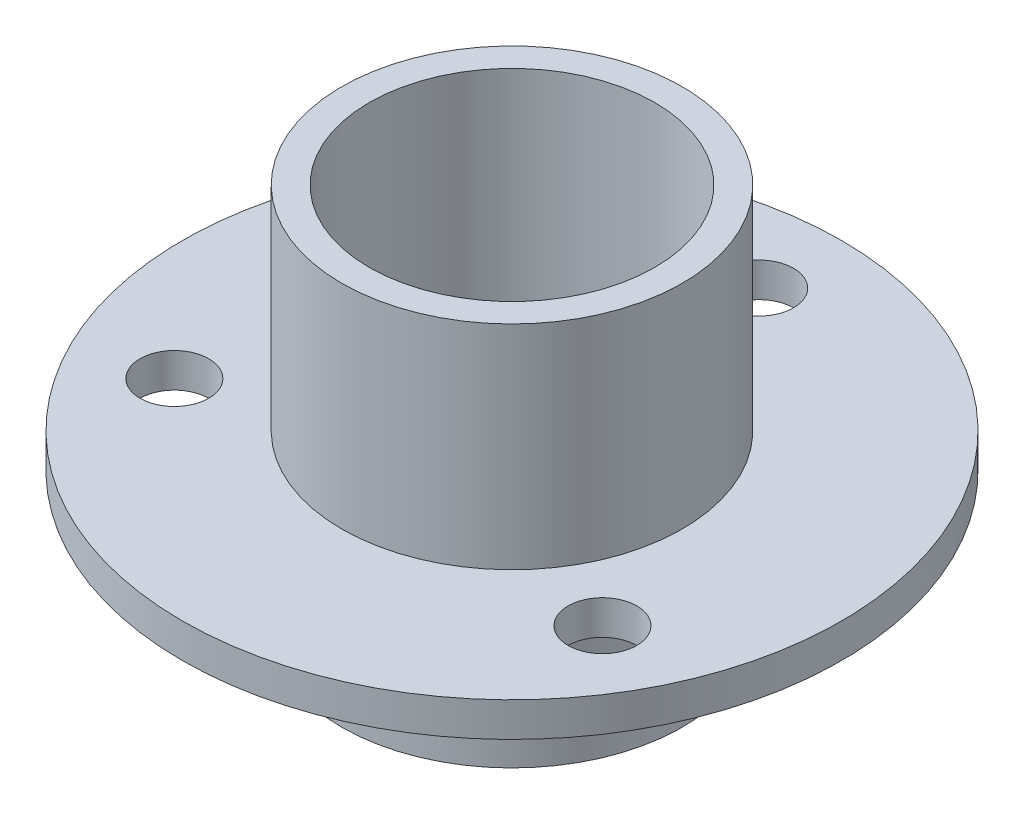
ISO-10303-21;
HEADER;
FILE_DESCRIPTION(('STEP AP214'),'2;1');
FILE_NAME('part.step','',(''),(''),'','','');
FILE_SCHEMA(('AUTOMOTIVE_DESIGN { 1 0 10303 214 1 1 1 1 }'));
ENDSEC;
DATA;
#1=APPLICATION_CONTEXT('core data for automotive mechanical design processes');
#2=APPLICATION_PROTOCOL_DEFINITION('international standard','automotive_design',2000,#1);
#3=PRODUCT_CONTEXT('',#1,'mechanical');
#4=PRODUCT('Part','Part','',(#3));
#5=PRODUCT_RELATED_PRODUCT_CATEGORY('part','',(#4));
#6=PRODUCT_DEFINITION_FORMATION('','',#4);
#7=PRODUCT_DEFINITION_CONTEXT('part definition',#1,'design');
#8=PRODUCT_DEFINITION('design','',#6,#7);
#9=PRODUCT_DEFINITION_SHAPE('','',#8);
#10=(LENGTH_UNIT() NAMED_UNIT(*) SI_UNIT(.MILLI.,.METRE.));
#11=(NAMED_UNIT(*) PLANE_ANGLE_UNIT() SI_UNIT($,.RADIAN.));
#12=(NAMED_UNIT(*) SI_UNIT($,.STERADIAN.) SOLID_ANGLE_UNIT());
#13=UNCERTAINTY_MEASURE_WITH_UNIT(LENGTH_MEASURE(1.E-05),#10,'distance_accuracy_value','');
#14=(GEOMETRIC_REPRESENTATION_CONTEXT(3) GLOBAL_UNCERTAINTY_ASSIGNED_CONTEXT((#13)) GLOBAL_UNIT_ASSIGNED_CONTEXT((#10,
#11,#12)) REPRESENTATION_CONTEXT('',''));
#15=CARTESIAN_POINT('',(0.,0.,0.));
#16=DIRECTION('',(0.,0.,1.));
#17=DIRECTION('',(1.,0.,0.));
#18=AXIS2_PLACEMENT_3D('',#15,#16,#17);
#19=CARTESIAN_POINT('',(0.,14.,0.));
#20=DIRECTION('',(0.,-1.,0.));
#21=DIRECTION('',(0.,0.,-1.));
#22=AXIS2_PLACEMENT_3D('',#19,#20,#21);
#23=CYLINDRICAL_SURFACE('',#22,6.2);
#24=CARTESIAN_POINT('',(0.,0.,0.));
#25=DIRECTION('',(0.,1.,0.));
#26=DIRECTION('',(0.,0.,1.));
#27=AXIS2_PLACEMENT_3D('',#24,#25,#26);
#28=CIRCLE('',#27,6.2);
#29=CARTESIAN_POINT('',(0.,0.,6.2));
#30=VERTEX_POINT('',#29);
#31=EDGE_CURVE('E36',#30,#30,#28,.T.);
#32=ORIENTED_EDGE('',*,*,#31,.T.);
#33=EDGE_LOOP('',(#32));
#34=FACE_BOUND('',#33,.T.);
#35=CARTESIAN_POINT('',(0.,4.999999906,0.));
#36=DIRECTION('',(0.,1.,0.));
#37=DIRECTION('',(0.,0.,1.));
#38=AXIS2_PLACEMENT_3D('',#35,#36,#37);
#39=CIRCLE('',#38,6.2);
#40=CARTESIAN_POINT('',(0.,4.999999906,6.2));
#41=VERTEX_POINT('',#40);
#42=EDGE_CURVE('E10',#41,#41,#39,.T.);
#43=ORIENTED_EDGE('',*,*,#42,.F.);
#44=EDGE_LOOP('',(#43));
#45=FACE_BOUND('',#44,.T.);
#46=ADVANCED_FACE('F32',(#34,#45),#23,.T.);
#47=CARTESIAN_POINT('',(0.,14.,0.));
#48=DIRECTION('',(0.,1.,0.));
#49=DIRECTION('',(0.,0.,1.));
#50=AXIS2_PLACEMENT_3D('',#47,#48,#49);
#51=PLANE('',#50);
#52=CARTESIAN_POINT('',(0.,14.,0.));
#53=DIRECTION('',(0.,1.,0.));
#54=DIRECTION('',(0.,0.,1.));
#55=AXIS2_PLACEMENT_3D('',#52,#53,#54);
#56=CIRCLE('',#55,6.2);
#57=CARTESIAN_POINT('',(0.,14.,6.2));
#58=VERTEX_POINT('',#57);
#59=EDGE_CURVE('E40',#58,#58,#56,.T.);
#60=ORIENTED_EDGE('',*,*,#59,.T.);
#61=EDGE_LOOP('',(#60));
#62=FACE_BOUND('',#61,.T.);
#63=CARTESIAN_POINT('',(0.,14.,0.));
#64=DIRECTION('',(0.,1.,0.));
#65=DIRECTION('',(0.,0.,1.));
#66=AXIS2_PLACEMENT_3D('',#63,#64,#65);
#67=CIRCLE('',#66,5.2);
#68=CARTESIAN_POINT('',(0.,14.,5.2));
#69=VERTEX_POINT('',#68);
#70=EDGE_CURVE('E54',#69,#69,#67,.T.);
#71=ORIENTED_EDGE('',*,*,#70,.F.);
#72=EDGE_LOOP('',(#71));
#73=FACE_BOUND('',#72,.T.);
#74=ADVANCED_FACE('F78',(#62,#73),#51,.T.);
#75=CARTESIAN_POINT('',(0.,0.,0.));
#76=DIRECTION('',(0.,1.,0.));
#77=DIRECTION('',(0.,0.,1.));
#78=AXIS2_PLACEMENT_3D('',#75,#76,#77);
#79=PLANE('',#78);
#80=ORIENTED_EDGE('',*,*,#31,.F.);
#81=EDGE_LOOP('',(#80));
#82=FACE_BOUND('',#81,.T.);
#83=CARTESIAN_POINT('',(0.,0.,0.));
#84=DIRECTION('',(0.,1.,0.));
#85=DIRECTION('',(0.,0.,1.));
#86=AXIS2_PLACEMENT_3D('',#83,#84,#85);
#87=CIRCLE('',#86,5.2);
#88=CARTESIAN_POINT('',(0.,0.,5.2));
#89=VERTEX_POINT('',#88);
#90=EDGE_CURVE('E52',#89,#89,#87,.T.);
#91=ORIENTED_EDGE('',*,*,#90,.T.);
#92=EDGE_LOOP('',(#91));
#93=FACE_BOUND('',#92,.T.);
#94=ADVANCED_FACE('F60',(#82,#93),#79,.F.);
#95=CARTESIAN_POINT('',(0.,6.249999906,0.));
#96=DIRECTION('',(0.,1.,0.));
#97=DIRECTION('',(0.,0.,1.));
#98=AXIS2_PLACEMENT_3D('',#95,#96,#97);
#99=CIRCLE('',#98,6.2);
#100=CARTESIAN_POINT('',(0.,6.249999906,6.2));
#101=VERTEX_POINT('',#100);
#102=EDGE_CURVE('E49',#101,#101,#99,.T.);
#103=ORIENTED_EDGE('',*,*,#102,.T.);
#104=EDGE_LOOP('',(#103));
#105=FACE_BOUND('',#104,.T.);
#106=ORIENTED_EDGE('',*,*,#59,.F.);
#107=EDGE_LOOP('',(#106));
#108=FACE_BOUND('',#107,.T.);
#109=ADVANCED_FACE('F34',(#105,#108),#23,.T.);
#110=CARTESIAN_POINT('',(0.,14.,0.));
#111=DIRECTION('',(0.,-1.,0.));
#112=DIRECTION('',(0.,0.,-1.));
#113=AXIS2_PLACEMENT_3D('',#110,#111,#112);
#114=CYLINDRICAL_SURFACE('',#113,5.2);
#115=ORIENTED_EDGE('',*,*,#70,.T.);
#116=EDGE_LOOP('',(#115));
#117=FACE_BOUND('',#116,.T.);
#118=ORIENTED_EDGE('',*,*,#90,.F.);
#119=EDGE_LOOP('',(#118));
#120=FACE_BOUND('',#119,.T.);
#121=ADVANCED_FACE('F62',(#117,#120),#114,.F.);
#122=CARTESIAN_POINT('',(0.,6.249999906,0.));
#123=DIRECTION('',(0.,1.,0.));
#124=DIRECTION('',(0.,0.,1.));
#125=AXIS2_PLACEMENT_3D('',#122,#123,#124);
#126=PLANE('',#125);
#127=CARTESIAN_POINT('',(7.79422863405993,6.249999906,4.50000000000004));
#128=DIRECTION('',(0.,1.,0.));
#129=DIRECTION('',(0.,0.,1.));
#130=AXIS2_PLACEMENT_3D('',#127,#128,#129);
#131=CIRCLE('',#130,1.25);
#132=CARTESIAN_POINT('',(7.79422863405993,6.249999906,5.75000000000004));
#133=VERTEX_POINT('',#132);
#134=EDGE_CURVE('E173',#133,#133,#131,.T.);
#135=ORIENTED_EDGE('',*,*,#134,.F.);
#136=EDGE_LOOP('',(#135));
#137=FACE_BOUND('',#136,.T.);
#138=CARTESIAN_POINT('',(0.,6.249999906,0.));
#139=DIRECTION('',(0.,1.,0.));
#140=DIRECTION('',(0.,0.,1.));
#141=AXIS2_PLACEMENT_3D('',#138,#139,#140);
#142=CIRCLE('',#141,12.);
#143=CARTESIAN_POINT('',(0.,6.249999906,12.));
#144=VERTEX_POINT('',#143);
#145=EDGE_CURVE('E53',#144,#144,#142,.T.);
#146=ORIENTED_EDGE('',*,*,#145,.T.);
#147=EDGE_LOOP('',(#146));
#148=FACE_BOUND('',#147,.T.);
#149=CARTESIAN_POINT('',(0.,6.249999906,-9.));
#150=DIRECTION('',(0.,1.,0.));
#151=DIRECTION('',(0.,0.,1.));
#152=AXIS2_PLACEMENT_3D('',#149,#150,#151);
#153=CIRCLE('',#152,1.25);
#154=CARTESIAN_POINT('',(0.,6.249999906,-7.75));
#155=VERTEX_POINT('',#154);
#156=EDGE_CURVE('E179',#155,#155,#153,.T.);
#157=ORIENTED_EDGE('',*,*,#156,.F.);
#158=EDGE_LOOP('',(#157));
#159=FACE_BOUND('',#158,.T.);
#160=CARTESIAN_POINT('',(-7.79422863405999,6.249999906,4.49999999999993));
#161=DIRECTION('',(0.,1.,0.));
#162=DIRECTION('',(0.,0.,1.));
#163=AXIS2_PLACEMENT_3D('',#160,#161,#162);
#164=CIRCLE('',#163,1.25);
#165=CARTESIAN_POINT('',(-7.79422863405999,6.249999906,5.74999999999993));
#166=VERTEX_POINT('',#165);
#167=EDGE_CURVE('E164',#166,#166,#164,.T.);
#168=ORIENTED_EDGE('',*,*,#167,.F.);
#169=EDGE_LOOP('',(#168));
#170=FACE_BOUND('',#169,.T.);
#171=ORIENTED_EDGE('',*,*,#102,.F.);
#172=EDGE_LOOP('',(#171));
#173=FACE_BOUND('',#172,.T.);
#174=ADVANCED_FACE('F64',(#137,#148,#159,#170,#173),#126,.T.);
#175=CARTESIAN_POINT('',(0.,4.999999906,0.));
#176=DIRECTION('',(0.,1.,0.));
#177=DIRECTION('',(0.,0.,1.));
#178=AXIS2_PLACEMENT_3D('',#175,#176,#177);
#179=PLANE('',#178);
#180=CARTESIAN_POINT('',(7.79422863405993,4.999999906,4.50000000000004));
#181=DIRECTION('',(0.,1.,0.));
#182=DIRECTION('',(0.,0.,1.));
#183=AXIS2_PLACEMENT_3D('',#180,#181,#182);
#184=CIRCLE('',#183,1.25);
#185=CARTESIAN_POINT('',(7.79422863405993,4.999999906,5.75000000000004));
#186=VERTEX_POINT('',#185);
#187=EDGE_CURVE('E170',#186,#186,#184,.T.);
#188=ORIENTED_EDGE('',*,*,#187,.T.);
#189=EDGE_LOOP('',(#188));
#190=FACE_BOUND('',#189,.T.);
#191=CARTESIAN_POINT('',(0.,4.999999906,0.));
#192=DIRECTION('',(0.,1.,0.));
#193=DIRECTION('',(0.,0.,1.));
#194=AXIS2_PLACEMENT_3D('',#191,#192,#193);
#195=CIRCLE('',#194,12.);
#196=CARTESIAN_POINT('',(0.,4.999999906,12.));
#197=VERTEX_POINT('',#196);
#198=EDGE_CURVE('E47',#197,#197,#195,.T.);
#199=ORIENTED_EDGE('',*,*,#198,.F.);
#200=EDGE_LOOP('',(#199));
#201=FACE_BOUND('',#200,.T.);
#202=CARTESIAN_POINT('',(0.,4.999999906,-9.));
#203=DIRECTION('',(0.,1.,0.));
#204=DIRECTION('',(0.,0.,1.));
#205=AXIS2_PLACEMENT_3D('',#202,#203,#204);
#206=CIRCLE('',#205,1.25);
#207=CARTESIAN_POINT('',(0.,4.999999906,-7.75));
#208=VERTEX_POINT('',#207);
#209=EDGE_CURVE('E176',#208,#208,#206,.T.);
#210=ORIENTED_EDGE('',*,*,#209,.T.);
#211=EDGE_LOOP('',(#210));
#212=FACE_BOUND('',#211,.T.);
#213=CARTESIAN_POINT('',(-7.79422863405999,4.999999906,4.49999999999993));
#214=DIRECTION('',(0.,1.,0.));
#215=DIRECTION('',(0.,0.,1.));
#216=AXIS2_PLACEMENT_3D('',#213,#214,#215);
#217=CIRCLE('',#216,1.25);
#218=CARTESIAN_POINT('',(-7.79422863405999,4.999999906,5.74999999999993));
#219=VERTEX_POINT('',#218);
#220=EDGE_CURVE('E167',#219,#219,#217,.T.);
#221=ORIENTED_EDGE('',*,*,#220,.T.);
#222=EDGE_LOOP('',(#221));
#223=FACE_BOUND('',#222,.T.);
#224=ORIENTED_EDGE('',*,*,#42,.T.);
#225=EDGE_LOOP('',(#224));
#226=FACE_BOUND('',#225,.T.);
#227=ADVANCED_FACE('F71',(#190,#201,#212,#223,#226),#179,.F.);
#228=CARTESIAN_POINT('',(0.,6.249999906,0.));
#229=DIRECTION('',(0.,-1.,0.));
#230=DIRECTION('',(0.,0.,-1.));
#231=AXIS2_PLACEMENT_3D('',#228,#229,#230);
#232=CYLINDRICAL_SURFACE('',#231,12.);
#233=ORIENTED_EDGE('',*,*,#145,.F.);
#234=EDGE_LOOP('',(#233));
#235=FACE_BOUND('',#234,.T.);
#236=ORIENTED_EDGE('',*,*,#198,.T.);
#237=EDGE_LOOP('',(#236));
#238=FACE_BOUND('',#237,.T.);
#239=ADVANCED_FACE('F118',(#235,#238),#232,.T.);
#240=CARTESIAN_POINT('',(0.,6.249999906,-9.));
#241=DIRECTION('',(0.,-1.,0.));
#242=DIRECTION('',(0.,0.,-1.));
#243=AXIS2_PLACEMENT_3D('',#240,#241,#242);
#244=CYLINDRICAL_SURFACE('',#243,1.25);
#245=ORIENTED_EDGE('',*,*,#156,.T.);
#246=EDGE_LOOP('',(#245));
#247=FACE_BOUND('',#246,.T.);
#248=ORIENTED_EDGE('',*,*,#209,.F.);
#249=EDGE_LOOP('',(#248));
#250=FACE_BOUND('',#249,.T.);
#251=ADVANCED_FACE('F128',(#247,#250),#244,.F.);
#252=CARTESIAN_POINT('',(7.79422863405993,6.249999906,4.50000000000004));
#253=DIRECTION('',(0.,-1.,0.));
#254=DIRECTION('',(0.,0.,-1.));
#255=AXIS2_PLACEMENT_3D('',#252,#253,#254);
#256=CYLINDRICAL_SURFACE('',#255,1.25);
#257=ORIENTED_EDGE('',*,*,#134,.T.);
#258=EDGE_LOOP('',(#257));
#259=FACE_BOUND('',#258,.T.);
#260=ORIENTED_EDGE('',*,*,#187,.F.);
#261=EDGE_LOOP('',(#260));
#262=FACE_BOUND('',#261,.T.);
#263=ADVANCED_FACE('F137',(#259,#262),#256,.F.);
#264=CARTESIAN_POINT('',(-7.79422863405999,6.249999906,4.49999999999993));
#265=DIRECTION('',(0.,-1.,0.));
#266=DIRECTION('',(0.,0.,-1.));
#267=AXIS2_PLACEMENT_3D('',#264,#265,#266);
#268=CYLINDRICAL_SURFACE('',#267,1.25);
#269=ORIENTED_EDGE('',*,*,#167,.T.);
#270=EDGE_LOOP('',(#269));
#271=FACE_BOUND('',#270,.T.);
#272=ORIENTED_EDGE('',*,*,#220,.F.);
#273=EDGE_LOOP('',(#272));
#274=FACE_BOUND('',#273,.T.);
#275=ADVANCED_FACE('F147',(#271,#274),#268,.F.);
#276=CLOSED_SHELL('',(#46,#74,#94,#109,#121,#174,#227,#239,#251,#263,#275));
#277=MANIFOLD_SOLID_BREP('B2',#276);
#278=ADVANCED_BREP_SHAPE_REPRESENTATION('',(#18,#277),#14);
#279=SHAPE_DEFINITION_REPRESENTATION(#9,#278);
ENDSEC;
END-ISO-10303-21;
